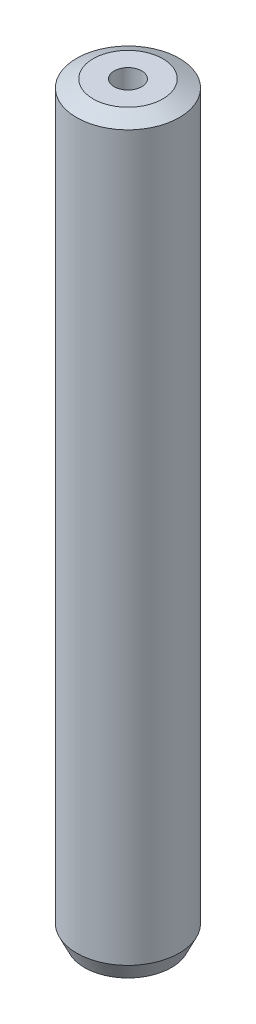
ISO-10303-21;
HEADER;
FILE_DESCRIPTION(('STEP AP214'),'2;1');
FILE_NAME('part.step','',(''),(''),'','','');
FILE_SCHEMA(('AUTOMOTIVE_DESIGN { 1 0 10303 214 1 1 1 1 }'));
ENDSEC;
DATA;
#1=APPLICATION_CONTEXT('core data for automotive mechanical design processes');
#2=APPLICATION_PROTOCOL_DEFINITION('international standard','automotive_design',2000,#1);
#3=PRODUCT_CONTEXT('',#1,'mechanical');
#4=PRODUCT('Part','Part','',(#3));
#5=PRODUCT_RELATED_PRODUCT_CATEGORY('part','',(#4));
#6=PRODUCT_DEFINITION_FORMATION('','',#4);
#7=PRODUCT_DEFINITION_CONTEXT('part definition',#1,'design');
#8=PRODUCT_DEFINITION('design','',#6,#7);
#9=PRODUCT_DEFINITION_SHAPE('','',#8);
#10=(LENGTH_UNIT() NAMED_UNIT(*) SI_UNIT(.MILLI.,.METRE.));
#11=(NAMED_UNIT(*) PLANE_ANGLE_UNIT() SI_UNIT($,.RADIAN.));
#12=(NAMED_UNIT(*) SI_UNIT($,.STERADIAN.) SOLID_ANGLE_UNIT());
#13=UNCERTAINTY_MEASURE_WITH_UNIT(LENGTH_MEASURE(1.E-05),#10,'distance_accuracy_value','');
#14=(GEOMETRIC_REPRESENTATION_CONTEXT(3) GLOBAL_UNCERTAINTY_ASSIGNED_CONTEXT((#13)) GLOBAL_UNIT_ASSIGNED_CONTEXT((#10,
#11,#12)) REPRESENTATION_CONTEXT('',''));
#15=CARTESIAN_POINT('',(0.,0.,0.));
#16=DIRECTION('',(0.,0.,1.));
#17=DIRECTION('',(1.,0.,0.));
#18=AXIS2_PLACEMENT_3D('',#15,#16,#17);
#19=CARTESIAN_POINT('',(0.,182.039537160457,0.));
#20=DIRECTION('',(0.,-1.,0.));
#21=DIRECTION('',(0.,0.,-1.));
#22=AXIS2_PLACEMENT_3D('',#19,#20,#21);
#23=CYLINDRICAL_SURFACE('',#22,12.5);
#24=CARTESIAN_POINT('',(0.,180.117752180272,0.));
#25=DIRECTION('',(0.,1.,0.));
#26=DIRECTION('',(0.,0.,1.));
#27=AXIS2_PLACEMENT_3D('',#24,#25,#26);
#28=CIRCLE('',#27,12.5);
#29=CARTESIAN_POINT('',(0.,180.117752180272,12.5));
#30=VERTEX_POINT('',#29);
#31=EDGE_CURVE('E50',#30,#30,#28,.F.);
#32=ORIENTED_EDGE('',*,*,#31,.T.);
#33=EDGE_LOOP('',(#32));
#34=FACE_BOUND('',#33,.T.);
#35=CARTESIAN_POINT('',(0.,4.02044663040832,0.));
#36=DIRECTION('',(0.,1.,0.));
#37=DIRECTION('',(0.,0.,1.));
#38=AXIS2_PLACEMENT_3D('',#35,#36,#37);
#39=CIRCLE('',#38,12.5);
#40=CARTESIAN_POINT('',(0.,4.02044663040832,12.5));
#41=VERTEX_POINT('',#40);
#42=EDGE_CURVE('E51',#41,#41,#39,.T.);
#43=ORIENTED_EDGE('',*,*,#42,.T.);
#44=EDGE_LOOP('',(#43));
#45=FACE_BOUND('',#44,.T.);
#46=ADVANCED_FACE('F39',(#34,#45),#23,.T.);
#47=CARTESIAN_POINT('',(0.,182.039537160457,0.));
#48=DIRECTION('',(0.,1.,0.));
#49=DIRECTION('',(0.,0.,1.));
#50=AXIS2_PLACEMENT_3D('',#47,#48,#49);
#51=PLANE('',#50);
#52=CARTESIAN_POINT('',(0.,182.039537160457,0.));
#53=DIRECTION('',(0.,1.,0.));
#54=DIRECTION('',(0.,0.,1.));
#55=AXIS2_PLACEMENT_3D('',#52,#53,#54);
#56=CIRCLE('',#55,8.47955336959169);
#57=CARTESIAN_POINT('',(0.,182.039537160457,8.47955336959169));
#58=VERTEX_POINT('',#57);
#59=EDGE_CURVE('E54',#58,#58,#56,.T.);
#60=ORIENTED_EDGE('',*,*,#59,.T.);
#61=EDGE_LOOP('',(#60));
#62=FACE_BOUND('',#61,.T.);
#63=CARTESIAN_POINT('',(0.,182.039537160457,0.));
#64=DIRECTION('',(0.,1.,0.));
#65=DIRECTION('',(0.,0.,1.));
#66=AXIS2_PLACEMENT_3D('',#63,#64,#65);
#67=CIRCLE('',#66,3.35296908393288);
#68=CARTESIAN_POINT('',(0.,182.039537160457,3.35296908393288));
#69=VERTEX_POINT('',#68);
#70=EDGE_CURVE('E58',#69,#69,#67,.T.);
#71=ORIENTED_EDGE('',*,*,#70,.F.);
#72=EDGE_LOOP('',(#71));
#73=FACE_BOUND('',#72,.T.);
#74=ADVANCED_FACE('F69',(#62,#73),#51,.T.);
#75=CARTESIAN_POINT('',(0.,0.,0.));
#76=DIRECTION('',(0.,1.,0.));
#77=DIRECTION('',(0.,0.,1.));
#78=AXIS2_PLACEMENT_3D('',#75,#76,#77);
#79=PLANE('',#78);
#80=CARTESIAN_POINT('',(0.,0.,0.));
#81=DIRECTION('',(0.,1.,0.));
#82=DIRECTION('',(0.,0.,1.));
#83=AXIS2_PLACEMENT_3D('',#80,#81,#82);
#84=CIRCLE('',#83,10.578215019815);
#85=CARTESIAN_POINT('',(0.,0.,10.578215019815));
#86=VERTEX_POINT('',#85);
#87=EDGE_CURVE('E10',#86,#86,#84,.F.);
#88=ORIENTED_EDGE('',*,*,#87,.T.);
#89=EDGE_LOOP('',(#88));
#90=FACE_BOUND('',#89,.T.);
#91=CARTESIAN_POINT('',(0.,0.,0.));
#92=DIRECTION('',(0.,1.,0.));
#93=DIRECTION('',(0.,0.,1.));
#94=AXIS2_PLACEMENT_3D('',#91,#92,#93);
#95=CIRCLE('',#94,3.35296908393288);
#96=CARTESIAN_POINT('',(0.,0.,3.35296908393288));
#97=VERTEX_POINT('',#96);
#98=EDGE_CURVE('E63',#97,#97,#95,.T.);
#99=ORIENTED_EDGE('',*,*,#98,.T.);
#100=EDGE_LOOP('',(#99));
#101=FACE_BOUND('',#100,.T.);
#102=ADVANCED_FACE('F75',(#90,#101),#79,.F.);
#103=CARTESIAN_POINT('',(0.,182.039537160457,0.));
#104=DIRECTION('',(0.,-1.,0.));
#105=DIRECTION('',(0.,0.,-1.));
#106=AXIS2_PLACEMENT_3D('',#103,#104,#105);
#107=CYLINDRICAL_SURFACE('',#106,3.35296908393288);
#108=ORIENTED_EDGE('',*,*,#70,.T.);
#109=EDGE_LOOP('',(#108));
#110=FACE_BOUND('',#109,.T.);
#111=ORIENTED_EDGE('',*,*,#98,.F.);
#112=EDGE_LOOP('',(#111));
#113=FACE_BOUND('',#112,.T.);
#114=ADVANCED_FACE('F70',(#110,#113),#107,.F.);
#115=CARTESIAN_POINT('',(0.,182.039537160457,0.));
#116=DIRECTION('',(0.,-1.,0.));
#117=DIRECTION('',(0.,0.,-1.));
#118=AXIS2_PLACEMENT_3D('',#115,#116,#117);
#119=CONICAL_SURFACE('',#118,8.47955336959169,1.12490078057447);
#120=ORIENTED_EDGE('',*,*,#31,.F.);
#121=EDGE_LOOP('',(#120));
#122=FACE_BOUND('',#121,.T.);
#123=ORIENTED_EDGE('',*,*,#59,.F.);
#124=EDGE_LOOP('',(#123));
#125=FACE_BOUND('',#124,.T.);
#126=ADVANCED_FACE('F81',(#122,#125),#119,.T.);
#127=CARTESIAN_POINT('',(0.,4.02044663040832,0.));
#128=DIRECTION('',(0.,1.,0.));
#129=DIRECTION('',(0.,0.,1.));
#130=AXIS2_PLACEMENT_3D('',#127,#128,#129);
#131=CONICAL_SURFACE('',#130,12.5,0.445895546220423);
#132=CARTESIAN_POINT('',(0.,0.,10.578215019815));
#133=CARTESIAN_POINT('',(0.,0.0418796524000859,10.5982336133586));
#134=CARTESIAN_POINT('',(0.,0.0837593048001723,10.6182522069022));
#135=CARTESIAN_POINT('',(0.,0.167518609600345,10.6582893939894));
#136=CARTESIAN_POINT('',(0.,0.209398262000432,10.678307987533));
#137=CARTESIAN_POINT('',(0.,0.293157566800605,10.7183451746202));
#138=CARTESIAN_POINT('',(0.,0.335037219200692,10.7383637681638));
#139=CARTESIAN_POINT('',(0.,0.418796524000865,10.778400955251));
#140=CARTESIAN_POINT('',(0.,0.460676176400952,10.7984195487946));
#141=CARTESIAN_POINT('',(0.,0.544435481201125,10.8384567358818));
#142=CARTESIAN_POINT('',(0.,0.586315133601212,10.8584753294253));
#143=CARTESIAN_POINT('',(0.,0.670074438401385,10.8985125165125));
#144=CARTESIAN_POINT('',(0.,0.711954090801472,10.9185311100561));
#145=CARTESIAN_POINT('',(0.,0.795713395601645,10.9585682971433));
#146=CARTESIAN_POINT('',(0.,0.837593048001732,10.9785868906869));
#147=CARTESIAN_POINT('',(0.,0.921352352801905,11.0186240777741));
#148=CARTESIAN_POINT('',(0.,0.963232005201992,11.0386426713177));
#149=CARTESIAN_POINT('',(0.,1.04699131000217,11.0786798584049));
#150=CARTESIAN_POINT('',(0.,1.08887096240225,11.0986984519485));
#151=CARTESIAN_POINT('',(0.,1.17263026720243,11.1387356390357));
#152=CARTESIAN_POINT('',(0.,1.21450991960251,11.1587542325792));
#153=CARTESIAN_POINT('',(0.,1.29826922440269,11.1987914196664));
#154=CARTESIAN_POINT('',(0.,1.34014887680277,11.21881001321));
#155=CARTESIAN_POINT('',(0.,1.42390818160295,11.2588472002972));
#156=CARTESIAN_POINT('',(0.,1.46578783400303,11.2788657938408));
#157=CARTESIAN_POINT('',(0.,1.54954713880321,11.318902980928));
#158=CARTESIAN_POINT('',(0.,1.59142679120329,11.3389215744716));
#159=CARTESIAN_POINT('',(0.,1.67518609600347,11.3789587615588));
#160=CARTESIAN_POINT('',(0.,1.71706574840355,11.3989773551024));
#161=CARTESIAN_POINT('',(0.,1.80082505320373,11.4390145421896));
#162=CARTESIAN_POINT('',(0.,1.84270470560381,11.4590331357331));
#163=CARTESIAN_POINT('',(0.,1.92646401040399,11.4990703228203));
#164=CARTESIAN_POINT('',(0.,1.96834366280407,11.5190889163639));
#165=CARTESIAN_POINT('',(0.,2.05210296760425,11.5591261034511));
#166=CARTESIAN_POINT('',(0.,2.09398262000433,11.5791446969947));
#167=CARTESIAN_POINT('',(0.,2.17774192480451,11.6191818840819));
#168=CARTESIAN_POINT('',(0.,2.21962157720459,11.6392004776255));
#169=CARTESIAN_POINT('',(0.,2.30338088200477,11.6792376647127));
#170=CARTESIAN_POINT('',(0.,2.34526053440485,11.6992562582563));
#171=CARTESIAN_POINT('',(0.,2.42901983920503,11.7392934453435));
#172=CARTESIAN_POINT('',(0.,2.47089949160511,11.759312038887));
#173=CARTESIAN_POINT('',(0.,2.55465879640529,11.7993492259742));
#174=CARTESIAN_POINT('',(0.,2.59653844880537,11.8193678195178));
#175=CARTESIAN_POINT('',(0.,2.68029775360555,11.859405006605));
#176=CARTESIAN_POINT('',(0.,2.72217740600563,11.8794236001486));
#177=CARTESIAN_POINT('',(0.,2.80593671080581,11.9194607872358));
#178=CARTESIAN_POINT('',(0.,2.84781636320589,11.9394793807794));
#179=CARTESIAN_POINT('',(0.,2.93157566800607,11.9795165678666));
#180=CARTESIAN_POINT('',(0.,2.97345532040615,11.9995351614102));
#181=CARTESIAN_POINT('',(0.,3.05721462520633,12.0395723484974));
#182=CARTESIAN_POINT('',(0.,3.09909427760641,12.0595909420409));
#183=CARTESIAN_POINT('',(0.,3.18285358240659,12.0996281291281));
#184=CARTESIAN_POINT('',(0.,3.22473323480667,12.1196467226717));
#185=CARTESIAN_POINT('',(0.,3.30849253960685,12.1596839097589));
#186=CARTESIAN_POINT('',(0.,3.35037219200693,12.1797025033025));
#187=CARTESIAN_POINT('',(0.,3.43413149680711,12.2197396903897));
#188=CARTESIAN_POINT('',(0.,3.47601114920719,12.2397582839333));
#189=CARTESIAN_POINT('',(0.,3.55977045400737,12.2797954710205));
#190=CARTESIAN_POINT('',(0.,3.60165010640745,12.2998140645641));
#191=CARTESIAN_POINT('',(0.,3.68540941120763,12.3398512516513));
#192=CARTESIAN_POINT('',(0.,3.72728906360771,12.3598698451948));
#193=CARTESIAN_POINT('',(0.,3.81104836840789,12.399907032282));
#194=CARTESIAN_POINT('',(0.,3.85292802080797,12.4199256258256));
#195=CARTESIAN_POINT('',(0.,3.93668732560815,12.4599628129128));
#196=CARTESIAN_POINT('',(0.,3.97856697800823,12.4799814064564));
#197=CARTESIAN_POINT('',(0.,4.02044663040832,12.5));
#198=B_SPLINE_CURVE_WITH_KNOTS('',3,(#132,#133,#134,#135,#136,#137,#138,#139,#140,#141,#142,
#143,#144,#145,#146,#147,#148,#149,#150,#151,#152,#153,#154,#155,#156,#157,#158,#159,#160,#161,
#162,#163,#164,#165,#166,#167,#168,#169,#170,#171,#172,#173,#174,#175,#176,#177,#178,#179,#180,
#181,#182,#183,#184,#185,#186,#187,#188,#189,#190,#191,#192,#193,#194,#195,#196,#197),
.UNSPECIFIED.,.F.,.F.,(4,2,2,2,2,2,2,2,2,2,2,2,2,2,2,2,2,2,2,2,2,2,2,2,2,2,2,2,2,2,2,2,4),(0.,
0.139254602629647,0.278509205259295,0.417763807888943,0.557018410518591,0.696273013148239,
0.835527615777886,0.974782218407534,1.11403682103718,1.25329142366683,1.39254602629648,
1.53180062892613,1.67105523155577,1.81030983418542,1.94956443681507,2.08881903944472,
2.22807364207437,2.36732824470401,2.50658284733366,2.64583744996331,2.78509205259296,
2.92434665522261,3.06360125785225,3.2028558604819,3.34211046311155,3.4813650657412,
3.62061966837085,3.75987427100049,3.89912887363014,4.03838347625979,4.17763807888944,
4.31689268151908,4.45614728414873),.UNSPECIFIED.);
#199=EDGE_CURVE('BSEAM45',#86,#41,#198,.T.);
#200=ORIENTED_EDGE('',*,*,#87,.F.);
#201=ORIENTED_EDGE('',*,*,#42,.F.);
#202=ORIENTED_EDGE('',*,*,#199,.T.);
#203=ORIENTED_EDGE('',*,*,#199,.F.);
#204=EDGE_LOOP('',(#200,#202,#201,#203));
#205=FACE_BOUND('',#204,.T.);
#206=ADVANCED_FACE('F45',(#205),#131,.T.);
#207=CLOSED_SHELL('',(#46,#74,#102,#114,#126,#206));
#208=MANIFOLD_SOLID_BREP('B2',#207);
#209=ADVANCED_BREP_SHAPE_REPRESENTATION('',(#18,#208),#14);
#210=SHAPE_DEFINITION_REPRESENTATION(#9,#209);
ENDSEC;
END-ISO-10303-21;
